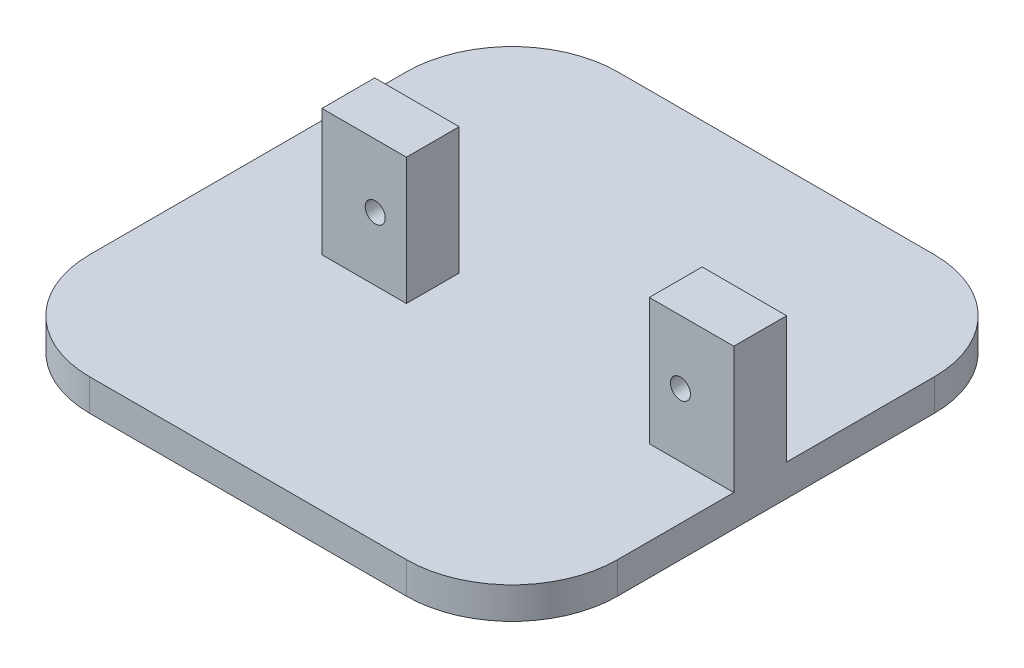
ISO-10303-21;
HEADER;
FILE_DESCRIPTION(('STEP AP214'),'2;1');
FILE_NAME('part.step','',(''),(''),'','','');
FILE_SCHEMA(('AUTOMOTIVE_DESIGN { 1 0 10303 214 1 1 1 1 }'));
ENDSEC;
DATA;
#1=APPLICATION_CONTEXT('core data for automotive mechanical design processes');
#2=APPLICATION_PROTOCOL_DEFINITION('international standard','automotive_design',2000,#1);
#3=PRODUCT_CONTEXT('',#1,'mechanical');
#4=PRODUCT('Part','Part','',(#3));
#5=PRODUCT_RELATED_PRODUCT_CATEGORY('part','',(#4));
#6=PRODUCT_DEFINITION_FORMATION('','',#4);
#7=PRODUCT_DEFINITION_CONTEXT('part definition',#1,'design');
#8=PRODUCT_DEFINITION('design','',#6,#7);
#9=PRODUCT_DEFINITION_SHAPE('','',#8);
#10=(LENGTH_UNIT() NAMED_UNIT(*) SI_UNIT(.MILLI.,.METRE.));
#11=(NAMED_UNIT(*) PLANE_ANGLE_UNIT() SI_UNIT($,.RADIAN.));
#12=(NAMED_UNIT(*) SI_UNIT($,.STERADIAN.) SOLID_ANGLE_UNIT());
#13=UNCERTAINTY_MEASURE_WITH_UNIT(LENGTH_MEASURE(1.E-05),#10,'distance_accuracy_value','');
#14=(GEOMETRIC_REPRESENTATION_CONTEXT(3) GLOBAL_UNCERTAINTY_ASSIGNED_CONTEXT((#13)) GLOBAL_UNIT_ASSIGNED_CONTEXT((#10,
#11,#12)) REPRESENTATION_CONTEXT('',''));
#15=CARTESIAN_POINT('',(0.,0.,0.));
#16=DIRECTION('',(0.,0.,1.));
#17=DIRECTION('',(1.,0.,0.));
#18=AXIS2_PLACEMENT_3D('',#15,#16,#17);
#19=CARTESIAN_POINT('',(15.,3.,-15.));
#20=DIRECTION('',(0.,1.,0.));
#21=DIRECTION('',(0.,0.,1.));
#22=AXIS2_PLACEMENT_3D('',#19,#20,#21);
#23=PLANE('',#22);
#24=DIRECTION('',(0.,0.,1.));
#25=VECTOR('',#24,1.);
#26=CARTESIAN_POINT('',(25.,3.,-14.9999999999999));
#27=LINE('',#26,#25);
#28=CARTESIAN_POINT('',(25.,3.,4.));
#29=VERTEX_POINT('',#28);
#30=CARTESIAN_POINT('',(25.,3.,14.9999999999999));
#31=VERTEX_POINT('',#30);
#32=EDGE_CURVE('E222',#29,#31,#27,.T.);
#33=ORIENTED_EDGE('',*,*,#32,.F.);
#34=DIRECTION('',(-1.,0.,0.));
#35=VECTOR('',#34,1.);
#36=CARTESIAN_POINT('',(15.,3.,4.));
#37=LINE('',#36,#35);
#38=CARTESIAN_POINT('',(17.,3.,4.));
#39=VERTEX_POINT('',#38);
#40=EDGE_CURVE('E209',#29,#39,#37,.T.);
#41=ORIENTED_EDGE('',*,*,#40,.T.);
#42=DIRECTION('',(0.,0.,-1.));
#43=VECTOR('',#42,1.);
#44=CARTESIAN_POINT('',(17.,3.,-15.));
#45=LINE('',#44,#43);
#46=CARTESIAN_POINT('',(17.,3.,-1.));
#47=VERTEX_POINT('',#46);
#48=EDGE_CURVE('E212',#39,#47,#45,.T.);
#49=ORIENTED_EDGE('',*,*,#48,.T.);
#50=DIRECTION('',(1.,0.,0.));
#51=VECTOR('',#50,1.);
#52=CARTESIAN_POINT('',(15.,3.,-1.));
#53=LINE('',#52,#51);
#54=CARTESIAN_POINT('',(25.,3.,-1.));
#55=VERTEX_POINT('',#54);
#56=EDGE_CURVE('E207',#47,#55,#53,.T.);
#57=ORIENTED_EDGE('',*,*,#56,.T.);
#58=CARTESIAN_POINT('',(25.,3.,-14.9999999999999));
#59=VERTEX_POINT('',#58);
#60=EDGE_CURVE('E223',#59,#55,#27,.T.);
#61=ORIENTED_EDGE('',*,*,#60,.F.);
#62=CARTESIAN_POINT('',(15.,3.,-15.));
#63=DIRECTION('',(0.,1.,0.));
#64=DIRECTION('',(0.,0.,1.));
#65=AXIS2_PLACEMENT_3D('',#62,#63,#64);
#66=CIRCLE('',#65,10.);
#67=CARTESIAN_POINT('',(14.9999999999999,3.,-25.));
#68=VERTEX_POINT('',#67);
#69=EDGE_CURVE('E219',#59,#68,#66,.T.);
#70=ORIENTED_EDGE('',*,*,#69,.T.);
#71=DIRECTION('',(1.,0.,0.));
#72=VECTOR('',#71,1.);
#73=CARTESIAN_POINT('',(-14.9999999999999,3.,-25.));
#74=LINE('',#73,#72);
#75=CARTESIAN_POINT('',(-14.9999999999999,3.,-25.));
#76=VERTEX_POINT('',#75);
#77=EDGE_CURVE('E216',#76,#68,#74,.T.);
#78=ORIENTED_EDGE('',*,*,#77,.F.);
#79=CARTESIAN_POINT('',(-15.,3.,-15.));
#80=DIRECTION('',(0.,1.,0.));
#81=DIRECTION('',(0.,0.,1.));
#82=AXIS2_PLACEMENT_3D('',#79,#80,#81);
#83=CIRCLE('',#82,10.);
#84=CARTESIAN_POINT('',(-25.,3.,-14.9999999999999));
#85=VERTEX_POINT('',#84);
#86=EDGE_CURVE('E236',#76,#85,#83,.T.);
#87=ORIENTED_EDGE('',*,*,#86,.T.);
#88=DIRECTION('',(0.,0.,1.));
#89=VECTOR('',#88,1.);
#90=CARTESIAN_POINT('',(-25.,3.,-14.9999999999999));
#91=LINE('',#90,#89);
#92=CARTESIAN_POINT('',(-25.,3.,14.9999999999999));
#93=VERTEX_POINT('',#92);
#94=EDGE_CURVE('E234',#85,#93,#91,.T.);
#95=ORIENTED_EDGE('',*,*,#94,.T.);
#96=CARTESIAN_POINT('',(-15.,3.,15.));
#97=DIRECTION('',(0.,-1.,0.));
#98=DIRECTION('',(0.,0.,-1.));
#99=AXIS2_PLACEMENT_3D('',#96,#97,#98);
#100=CIRCLE('',#99,10.);
#101=CARTESIAN_POINT('',(-14.9999999999999,3.,25.));
#102=VERTEX_POINT('',#101);
#103=EDGE_CURVE('E231',#102,#93,#100,.T.);
#104=ORIENTED_EDGE('',*,*,#103,.F.);
#105=DIRECTION('',(1.,0.,0.));
#106=VECTOR('',#105,1.);
#107=CARTESIAN_POINT('',(-14.9999999999999,3.,25.));
#108=LINE('',#107,#106);
#109=CARTESIAN_POINT('',(14.9999999999999,3.,25.));
#110=VERTEX_POINT('',#109);
#111=EDGE_CURVE('E229',#102,#110,#108,.T.);
#112=ORIENTED_EDGE('',*,*,#111,.T.);
#113=CARTESIAN_POINT('',(15.,3.,15.));
#114=DIRECTION('',(0.,-1.,0.));
#115=DIRECTION('',(0.,0.,-1.));
#116=AXIS2_PLACEMENT_3D('',#113,#114,#115);
#117=CIRCLE('',#116,10.);
#118=EDGE_CURVE('E226',#31,#110,#117,.T.);
#119=ORIENTED_EDGE('',*,*,#118,.F.);
#120=EDGE_LOOP('',(#33,#41,#49,#57,#61,#70,#78,#87,#95,#104,#112,#119));
#121=FACE_BOUND('',#120,.T.);
#122=DIRECTION('',(-1.,0.,0.));
#123=VECTOR('',#122,1.);
#124=CARTESIAN_POINT('',(15.,3.,3.99999999999999));
#125=LINE('',#124,#123);
#126=CARTESIAN_POINT('',(-5.99999999999999,3.,4.));
#127=VERTEX_POINT('',#126);
#128=CARTESIAN_POINT('',(-14.,3.,4.));
#129=VERTEX_POINT('',#128);
#130=EDGE_CURVE('E185',#127,#129,#125,.T.);
#131=ORIENTED_EDGE('',*,*,#130,.T.);
#132=DIRECTION('',(0.,0.,-1.));
#133=VECTOR('',#132,1.);
#134=CARTESIAN_POINT('',(-14.,3.,-15.));
#135=LINE('',#134,#133);
#136=CARTESIAN_POINT('',(-14.,3.,-1.));
#137=VERTEX_POINT('',#136);
#138=EDGE_CURVE('E174',#129,#137,#135,.T.);
#139=ORIENTED_EDGE('',*,*,#138,.T.);
#140=DIRECTION('',(1.,0.,0.));
#141=VECTOR('',#140,1.);
#142=CARTESIAN_POINT('',(15.,3.,-1.));
#143=LINE('',#142,#141);
#144=CARTESIAN_POINT('',(-6.,3.,-1.));
#145=VERTEX_POINT('',#144);
#146=EDGE_CURVE('E175',#137,#145,#143,.T.);
#147=ORIENTED_EDGE('',*,*,#146,.T.);
#148=DIRECTION('',(0.,0.,1.));
#149=VECTOR('',#148,1.);
#150=CARTESIAN_POINT('',(-5.99999999999999,3.,-15.));
#151=LINE('',#150,#149);
#152=EDGE_CURVE('E178',#145,#127,#151,.T.);
#153=ORIENTED_EDGE('',*,*,#152,.T.);
#154=EDGE_LOOP('',(#131,#139,#147,#153));
#155=FACE_BOUND('',#154,.T.);
#156=ADVANCED_FACE('F35',(#121,#155),#23,.T.);
#157=CARTESIAN_POINT('',(-14.9999999999999,3.,-25.));
#158=DIRECTION('',(0.,0.,-1.));
#159=DIRECTION('',(-1.,0.,0.));
#160=AXIS2_PLACEMENT_3D('',#157,#158,#159);
#161=PLANE('',#160);
#162=DIRECTION('',(1.,0.,0.));
#163=VECTOR('',#162,1.);
#164=CARTESIAN_POINT('',(-14.9999999999999,0.,-25.));
#165=LINE('',#164,#163);
#166=CARTESIAN_POINT('',(-14.9999999999999,0.,-25.));
#167=VERTEX_POINT('',#166);
#168=CARTESIAN_POINT('',(14.9999999999999,0.,-25.));
#169=VERTEX_POINT('',#168);
#170=EDGE_CURVE('E215',#167,#169,#165,.T.);
#171=ORIENTED_EDGE('',*,*,#170,.F.);
#172=DIRECTION('',(0.,-1.,0.));
#173=VECTOR('',#172,1.);
#174=CARTESIAN_POINT('',(-14.9999999999999,3.,-25.));
#175=LINE('',#174,#173);
#176=EDGE_CURVE('E11',#76,#167,#175,.T.);
#177=ORIENTED_EDGE('',*,*,#176,.F.);
#178=ORIENTED_EDGE('',*,*,#77,.T.);
#179=DIRECTION('',(0.,-1.,0.));
#180=VECTOR('',#179,1.);
#181=CARTESIAN_POINT('',(14.9999999999999,3.,-25.));
#182=LINE('',#181,#180);
#183=EDGE_CURVE('E39',#68,#169,#182,.T.);
#184=ORIENTED_EDGE('',*,*,#183,.T.);
#185=EDGE_LOOP('',(#171,#177,#178,#184));
#186=FACE_BOUND('',#185,.T.);
#187=ADVANCED_FACE('F37',(#186),#161,.T.);
#188=CARTESIAN_POINT('',(-15.,3.,-15.));
#189=DIRECTION('',(0.,-1.,0.));
#190=DIRECTION('',(0.,0.,-1.));
#191=AXIS2_PLACEMENT_3D('',#188,#189,#190);
#192=CYLINDRICAL_SURFACE('',#191,10.);
#193=CARTESIAN_POINT('',(-15.,0.,-15.));
#194=DIRECTION('',(0.,1.,0.));
#195=DIRECTION('',(0.,0.,1.));
#196=AXIS2_PLACEMENT_3D('',#193,#194,#195);
#197=CIRCLE('',#196,10.);
#198=CARTESIAN_POINT('',(-25.,0.,-14.9999999999999));
#199=VERTEX_POINT('',#198);
#200=EDGE_CURVE('E220',#167,#199,#197,.T.);
#201=ORIENTED_EDGE('',*,*,#200,.T.);
#202=DIRECTION('',(0.,-1.,0.));
#203=VECTOR('',#202,1.);
#204=CARTESIAN_POINT('',(-25.,3.,-14.9999999999999));
#205=LINE('',#204,#203);
#206=EDGE_CURVE('E44',#85,#199,#205,.T.);
#207=ORIENTED_EDGE('',*,*,#206,.F.);
#208=ORIENTED_EDGE('',*,*,#86,.F.);
#209=ORIENTED_EDGE('',*,*,#176,.T.);
#210=EDGE_LOOP('',(#201,#207,#208,#209));
#211=FACE_BOUND('',#210,.T.);
#212=ADVANCED_FACE('F284',(#211),#192,.T.);
#213=CARTESIAN_POINT('',(-25.,3.,-14.9999999999999));
#214=DIRECTION('',(1.,0.,0.));
#215=DIRECTION('',(0.,0.,-1.));
#216=AXIS2_PLACEMENT_3D('',#213,#214,#215);
#217=PLANE('',#216);
#218=DIRECTION('',(0.,0.,1.));
#219=VECTOR('',#218,1.);
#220=CARTESIAN_POINT('',(-25.,0.,-14.9999999999999));
#221=LINE('',#220,#219);
#222=CARTESIAN_POINT('',(-25.,0.,14.9999999999999));
#223=VERTEX_POINT('',#222);
#224=EDGE_CURVE('E254',#199,#223,#221,.T.);
#225=ORIENTED_EDGE('',*,*,#224,.T.);
#226=DIRECTION('',(0.,-1.,0.));
#227=VECTOR('',#226,1.);
#228=CARTESIAN_POINT('',(-25.,3.,14.9999999999999));
#229=LINE('',#228,#227);
#230=EDGE_CURVE('E260',#93,#223,#229,.T.);
#231=ORIENTED_EDGE('',*,*,#230,.F.);
#232=ORIENTED_EDGE('',*,*,#94,.F.);
#233=ORIENTED_EDGE('',*,*,#206,.T.);
#234=EDGE_LOOP('',(#225,#231,#232,#233));
#235=FACE_BOUND('',#234,.T.);
#236=ADVANCED_FACE('F288',(#235),#217,.F.);
#237=CARTESIAN_POINT('',(-15.,3.,15.));
#238=DIRECTION('',(0.,-1.,0.));
#239=DIRECTION('',(0.,0.,-1.));
#240=AXIS2_PLACEMENT_3D('',#237,#238,#239);
#241=CYLINDRICAL_SURFACE('',#240,10.);
#242=CARTESIAN_POINT('',(-15.,0.,15.));
#243=DIRECTION('',(0.,-1.,0.));
#244=DIRECTION('',(0.,0.,-1.));
#245=AXIS2_PLACEMENT_3D('',#242,#243,#244);
#246=CIRCLE('',#245,10.);
#247=CARTESIAN_POINT('',(-14.9999999999999,0.,25.));
#248=VERTEX_POINT('',#247);
#249=EDGE_CURVE('E251',#248,#223,#246,.T.);
#250=ORIENTED_EDGE('',*,*,#249,.F.);
#251=DIRECTION('',(0.,-1.,0.));
#252=VECTOR('',#251,1.);
#253=CARTESIAN_POINT('',(-14.9999999999999,3.,25.));
#254=LINE('',#253,#252);
#255=EDGE_CURVE('E262',#102,#248,#254,.T.);
#256=ORIENTED_EDGE('',*,*,#255,.F.);
#257=ORIENTED_EDGE('',*,*,#103,.T.);
#258=ORIENTED_EDGE('',*,*,#230,.T.);
#259=EDGE_LOOP('',(#250,#256,#257,#258));
#260=FACE_BOUND('',#259,.T.);
#261=ADVANCED_FACE('F310',(#260),#241,.T.);
#262=CARTESIAN_POINT('',(-14.9999999999999,3.,25.));
#263=DIRECTION('',(0.,0.,-1.));
#264=DIRECTION('',(-1.,0.,0.));
#265=AXIS2_PLACEMENT_3D('',#262,#263,#264);
#266=PLANE('',#265);
#267=DIRECTION('',(1.,0.,0.));
#268=VECTOR('',#267,1.);
#269=CARTESIAN_POINT('',(-14.9999999999999,0.,25.));
#270=LINE('',#269,#268);
#271=CARTESIAN_POINT('',(14.9999999999999,0.,25.));
#272=VERTEX_POINT('',#271);
#273=EDGE_CURVE('E248',#248,#272,#270,.T.);
#274=ORIENTED_EDGE('',*,*,#273,.T.);
#275=DIRECTION('',(0.,-1.,0.));
#276=VECTOR('',#275,1.);
#277=CARTESIAN_POINT('',(14.9999999999999,3.,25.));
#278=LINE('',#277,#276);
#279=EDGE_CURVE('E264',#110,#272,#278,.T.);
#280=ORIENTED_EDGE('',*,*,#279,.F.);
#281=ORIENTED_EDGE('',*,*,#111,.F.);
#282=ORIENTED_EDGE('',*,*,#255,.T.);
#283=EDGE_LOOP('',(#274,#280,#281,#282));
#284=FACE_BOUND('',#283,.T.);
#285=ADVANCED_FACE('F308',(#284),#266,.F.);
#286=CARTESIAN_POINT('',(15.,3.,15.));
#287=DIRECTION('',(0.,-1.,0.));
#288=DIRECTION('',(0.,0.,-1.));
#289=AXIS2_PLACEMENT_3D('',#286,#287,#288);
#290=CYLINDRICAL_SURFACE('',#289,10.);
#291=CARTESIAN_POINT('',(15.,0.,15.));
#292=DIRECTION('',(0.,-1.,0.));
#293=DIRECTION('',(0.,0.,-1.));
#294=AXIS2_PLACEMENT_3D('',#291,#292,#293);
#295=CIRCLE('',#294,10.);
#296=CARTESIAN_POINT('',(25.,0.,14.9999999999999));
#297=VERTEX_POINT('',#296);
#298=EDGE_CURVE('E245',#297,#272,#295,.T.);
#299=ORIENTED_EDGE('',*,*,#298,.F.);
#300=DIRECTION('',(0.,-1.,0.));
#301=VECTOR('',#300,1.);
#302=CARTESIAN_POINT('',(25.,3.,14.9999999999999));
#303=LINE('',#302,#301);
#304=EDGE_CURVE('E266',#31,#297,#303,.T.);
#305=ORIENTED_EDGE('',*,*,#304,.F.);
#306=ORIENTED_EDGE('',*,*,#118,.T.);
#307=ORIENTED_EDGE('',*,*,#279,.T.);
#308=EDGE_LOOP('',(#299,#305,#306,#307));
#309=FACE_BOUND('',#308,.T.);
#310=ADVANCED_FACE('F303',(#309),#290,.T.);
#311=CARTESIAN_POINT('',(25.,3.,-14.9999999999999));
#312=DIRECTION('',(1.,0.,0.));
#313=DIRECTION('',(0.,0.,-1.));
#314=AXIS2_PLACEMENT_3D('',#311,#312,#313);
#315=PLANE('',#314);
#316=DIRECTION('',(0.,-1.,0.));
#317=VECTOR('',#316,1.);
#318=CARTESIAN_POINT('',(25.,15.,4.));
#319=LINE('',#318,#317);
#320=CARTESIAN_POINT('',(25.,15.,4.));
#321=VERTEX_POINT('',#320);
#322=EDGE_CURVE('E201',#321,#29,#319,.T.);
#323=ORIENTED_EDGE('',*,*,#322,.T.);
#324=ORIENTED_EDGE('',*,*,#32,.T.);
#325=ORIENTED_EDGE('',*,*,#304,.T.);
#326=DIRECTION('',(0.,0.,1.));
#327=VECTOR('',#326,1.);
#328=CARTESIAN_POINT('',(25.,0.,-14.9999999999999));
#329=LINE('',#328,#327);
#330=CARTESIAN_POINT('',(25.,0.,-14.9999999999999));
#331=VERTEX_POINT('',#330);
#332=EDGE_CURVE('E243',#331,#297,#329,.T.);
#333=ORIENTED_EDGE('',*,*,#332,.F.);
#334=DIRECTION('',(0.,-1.,0.));
#335=VECTOR('',#334,1.);
#336=CARTESIAN_POINT('',(25.,3.,-14.9999999999999));
#337=LINE('',#336,#335);
#338=EDGE_CURVE('E268',#59,#331,#337,.T.);
#339=ORIENTED_EDGE('',*,*,#338,.F.);
#340=ORIENTED_EDGE('',*,*,#60,.T.);
#341=DIRECTION('',(0.,-1.,0.));
#342=VECTOR('',#341,1.);
#343=CARTESIAN_POINT('',(25.,15.,-1.));
#344=LINE('',#343,#342);
#345=CARTESIAN_POINT('',(25.,15.,-1.));
#346=VERTEX_POINT('',#345);
#347=EDGE_CURVE('E60',#346,#55,#344,.T.);
#348=ORIENTED_EDGE('',*,*,#347,.F.);
#349=DIRECTION('',(0.,0.,-1.));
#350=VECTOR('',#349,1.);
#351=CARTESIAN_POINT('',(25.,15.,-1.));
#352=LINE('',#351,#350);
#353=EDGE_CURVE('E193',#321,#346,#352,.T.);
#354=ORIENTED_EDGE('',*,*,#353,.F.);
#355=EDGE_LOOP('',(#323,#324,#325,#333,#339,#340,#348,#354));
#356=FACE_BOUND('',#355,.T.);
#357=ADVANCED_FACE('F296',(#356),#315,.T.);
#358=CARTESIAN_POINT('',(15.,3.,-15.));
#359=DIRECTION('',(0.,-1.,0.));
#360=DIRECTION('',(0.,0.,-1.));
#361=AXIS2_PLACEMENT_3D('',#358,#359,#360);
#362=CYLINDRICAL_SURFACE('',#361,10.);
#363=CARTESIAN_POINT('',(15.,0.,-15.));
#364=DIRECTION('',(0.,1.,0.));
#365=DIRECTION('',(0.,0.,1.));
#366=AXIS2_PLACEMENT_3D('',#363,#364,#365);
#367=CIRCLE('',#366,10.);
#368=EDGE_CURVE('E240',#331,#169,#367,.T.);
#369=ORIENTED_EDGE('',*,*,#368,.T.);
#370=ORIENTED_EDGE('',*,*,#183,.F.);
#371=ORIENTED_EDGE('',*,*,#69,.F.);
#372=ORIENTED_EDGE('',*,*,#338,.T.);
#373=EDGE_LOOP('',(#369,#370,#371,#372));
#374=FACE_BOUND('',#373,.T.);
#375=ADVANCED_FACE('F276',(#374),#362,.T.);
#376=CARTESIAN_POINT('',(15.,0.,-15.));
#377=DIRECTION('',(0.,1.,0.));
#378=DIRECTION('',(0.,0.,1.));
#379=AXIS2_PLACEMENT_3D('',#376,#377,#378);
#380=PLANE('',#379);
#381=ORIENTED_EDGE('',*,*,#332,.T.);
#382=ORIENTED_EDGE('',*,*,#298,.T.);
#383=ORIENTED_EDGE('',*,*,#273,.F.);
#384=ORIENTED_EDGE('',*,*,#249,.T.);
#385=ORIENTED_EDGE('',*,*,#224,.F.);
#386=ORIENTED_EDGE('',*,*,#200,.F.);
#387=ORIENTED_EDGE('',*,*,#170,.T.);
#388=ORIENTED_EDGE('',*,*,#368,.F.);
#389=EDGE_LOOP('',(#381,#382,#383,#384,#385,#386,#387,#388));
#390=FACE_BOUND('',#389,.T.);
#391=ADVANCED_FACE('F280',(#390),#380,.F.);
#392=CARTESIAN_POINT('',(17.,15.,-1.));
#393=DIRECTION('',(1.,0.,0.));
#394=DIRECTION('',(0.,0.,-1.));
#395=AXIS2_PLACEMENT_3D('',#392,#393,#394);
#396=PLANE('',#395);
#397=ORIENTED_EDGE('',*,*,#48,.F.);
#398=DIRECTION('',(0.,-1.,0.));
#399=VECTOR('',#398,1.);
#400=CARTESIAN_POINT('',(17.,15.,4.));
#401=LINE('',#400,#399);
#402=CARTESIAN_POINT('',(17.,15.,4.));
#403=VERTEX_POINT('',#402);
#404=EDGE_CURVE('E204',#403,#39,#401,.T.);
#405=ORIENTED_EDGE('',*,*,#404,.F.);
#406=DIRECTION('',(0.,0.,1.));
#407=VECTOR('',#406,1.);
#408=CARTESIAN_POINT('',(17.,15.,-1.));
#409=LINE('',#408,#407);
#410=CARTESIAN_POINT('',(17.,15.,-1.));
#411=VERTEX_POINT('',#410);
#412=EDGE_CURVE('E188',#411,#403,#409,.T.);
#413=ORIENTED_EDGE('',*,*,#412,.F.);
#414=DIRECTION('',(0.,-1.,0.));
#415=VECTOR('',#414,1.);
#416=CARTESIAN_POINT('',(17.,15.,-1.));
#417=LINE('',#416,#415);
#418=EDGE_CURVE('E197',#411,#47,#417,.T.);
#419=ORIENTED_EDGE('',*,*,#418,.T.);
#420=EDGE_LOOP('',(#397,#405,#413,#419));
#421=FACE_BOUND('',#420,.T.);
#422=ADVANCED_FACE('F326',(#421),#396,.F.);
#423=CARTESIAN_POINT('',(17.,15.,4.));
#424=DIRECTION('',(0.,0.,-1.));
#425=DIRECTION('',(-1.,0.,0.));
#426=AXIS2_PLACEMENT_3D('',#423,#424,#425);
#427=PLANE('',#426);
#428=CARTESIAN_POINT('',(19.95,9.,4.));
#429=DIRECTION('',(0.,0.,-1.));
#430=DIRECTION('',(-1.,0.,0.));
#431=AXIS2_PLACEMENT_3D('',#428,#429,#430);
#432=CIRCLE('',#431,0.950000000000001);
#433=CARTESIAN_POINT('',(19.,9.,4.));
#434=VERTEX_POINT('',#433);
#435=EDGE_CURVE('E495',#434,#434,#432,.T.);
#436=ORIENTED_EDGE('',*,*,#435,.T.);
#437=EDGE_LOOP('',(#436));
#438=FACE_BOUND('',#437,.T.);
#439=ORIENTED_EDGE('',*,*,#40,.F.);
#440=ORIENTED_EDGE('',*,*,#322,.F.);
#441=DIRECTION('',(1.,0.,0.));
#442=VECTOR('',#441,1.);
#443=CARTESIAN_POINT('',(17.,15.,4.));
#444=LINE('',#443,#442);
#445=EDGE_CURVE('E191',#403,#321,#444,.T.);
#446=ORIENTED_EDGE('',*,*,#445,.F.);
#447=ORIENTED_EDGE('',*,*,#404,.T.);
#448=EDGE_LOOP('',(#439,#440,#446,#447));
#449=FACE_BOUND('',#448,.T.);
#450=ADVANCED_FACE('F392',(#438,#449),#427,.F.);
#451=CARTESIAN_POINT('',(17.,15.,-1.));
#452=DIRECTION('',(0.,0.,1.));
#453=DIRECTION('',(1.,0.,0.));
#454=AXIS2_PLACEMENT_3D('',#451,#452,#453);
#455=PLANE('',#454);
#456=CARTESIAN_POINT('',(19.95,9.,-1.00000000000001));
#457=DIRECTION('',(0.,0.,-1.));
#458=DIRECTION('',(-1.,0.,0.));
#459=AXIS2_PLACEMENT_3D('',#456,#457,#458);
#460=CIRCLE('',#459,0.950000000000001);
#461=CARTESIAN_POINT('',(19.,9.,-1.));
#462=VERTEX_POINT('',#461);
#463=EDGE_CURVE('E492',#462,#462,#460,.T.);
#464=ORIENTED_EDGE('',*,*,#463,.F.);
#465=EDGE_LOOP('',(#464));
#466=FACE_BOUND('',#465,.T.);
#467=ORIENTED_EDGE('',*,*,#56,.F.);
#468=ORIENTED_EDGE('',*,*,#418,.F.);
#469=DIRECTION('',(-1.,0.,0.));
#470=VECTOR('',#469,1.);
#471=CARTESIAN_POINT('',(17.,15.,-1.));
#472=LINE('',#471,#470);
#473=EDGE_CURVE('E195',#346,#411,#472,.T.);
#474=ORIENTED_EDGE('',*,*,#473,.F.);
#475=ORIENTED_EDGE('',*,*,#347,.T.);
#476=EDGE_LOOP('',(#467,#468,#474,#475));
#477=FACE_BOUND('',#476,.T.);
#478=ADVANCED_FACE('F404',(#466,#477),#455,.F.);
#479=CARTESIAN_POINT('',(0.,15.,0.));
#480=DIRECTION('',(0.,1.,0.));
#481=DIRECTION('',(0.,0.,1.));
#482=AXIS2_PLACEMENT_3D('',#479,#480,#481);
#483=PLANE('',#482);
#484=ORIENTED_EDGE('',*,*,#412,.T.);
#485=ORIENTED_EDGE('',*,*,#445,.T.);
#486=ORIENTED_EDGE('',*,*,#353,.T.);
#487=ORIENTED_EDGE('',*,*,#473,.T.);
#488=EDGE_LOOP('',(#484,#485,#486,#487));
#489=FACE_BOUND('',#488,.T.);
#490=ADVANCED_FACE('F399',(#489),#483,.T.);
#491=CARTESIAN_POINT('',(-14.,15.,-1.));
#492=DIRECTION('',(1.,0.,0.));
#493=DIRECTION('',(0.,0.,-1.));
#494=AXIS2_PLACEMENT_3D('',#491,#492,#493);
#495=PLANE('',#494);
#496=ORIENTED_EDGE('',*,*,#138,.F.);
#497=DIRECTION('',(0.,-1.,0.));
#498=VECTOR('',#497,1.);
#499=CARTESIAN_POINT('',(-14.,15.,4.));
#500=LINE('',#499,#498);
#501=CARTESIAN_POINT('',(-14.,15.,4.));
#502=VERTEX_POINT('',#501);
#503=EDGE_CURVE('E155',#502,#129,#500,.T.);
#504=ORIENTED_EDGE('',*,*,#503,.F.);
#505=DIRECTION('',(0.,0.,1.));
#506=VECTOR('',#505,1.);
#507=CARTESIAN_POINT('',(-14.,15.,-1.));
#508=LINE('',#507,#506);
#509=CARTESIAN_POINT('',(-14.,15.,-1.));
#510=VERTEX_POINT('',#509);
#511=EDGE_CURVE('E162',#510,#502,#508,.T.);
#512=ORIENTED_EDGE('',*,*,#511,.F.);
#513=DIRECTION('',(0.,-1.,0.));
#514=VECTOR('',#513,1.);
#515=CARTESIAN_POINT('',(-14.,15.,-1.));
#516=LINE('',#515,#514);
#517=EDGE_CURVE('E506',#510,#137,#516,.T.);
#518=ORIENTED_EDGE('',*,*,#517,.T.);
#519=EDGE_LOOP('',(#496,#504,#512,#518));
#520=FACE_BOUND('',#519,.T.);
#521=ADVANCED_FACE('F172',(#520),#495,.F.);
#522=CARTESIAN_POINT('',(-5.99999999999999,15.,4.));
#523=DIRECTION('',(0.,0.,-1.));
#524=DIRECTION('',(-1.,0.,0.));
#525=AXIS2_PLACEMENT_3D('',#522,#523,#524);
#526=PLANE('',#525);
#527=CARTESIAN_POINT('',(-8.95,9.,4.));
#528=DIRECTION('',(0.,0.,-1.));
#529=DIRECTION('',(-1.,0.,0.));
#530=AXIS2_PLACEMENT_3D('',#527,#528,#529);
#531=CIRCLE('',#530,0.949999999999999);
#532=CARTESIAN_POINT('',(-9.9,9.,4.));
#533=VERTEX_POINT('',#532);
#534=EDGE_CURVE('E170',#533,#533,#531,.T.);
#535=ORIENTED_EDGE('',*,*,#534,.T.);
#536=EDGE_LOOP('',(#535));
#537=FACE_BOUND('',#536,.T.);
#538=ORIENTED_EDGE('',*,*,#130,.F.);
#539=DIRECTION('',(0.,-1.,0.));
#540=VECTOR('',#539,1.);
#541=CARTESIAN_POINT('',(-5.99999999999999,15.,4.));
#542=LINE('',#541,#540);
#543=CARTESIAN_POINT('',(-5.99999999999999,15.,4.));
#544=VERTEX_POINT('',#543);
#545=EDGE_CURVE('E158',#544,#127,#542,.T.);
#546=ORIENTED_EDGE('',*,*,#545,.F.);
#547=DIRECTION('',(1.,0.,0.));
#548=VECTOR('',#547,1.);
#549=CARTESIAN_POINT('',(-5.99999999999999,15.,4.));
#550=LINE('',#549,#548);
#551=EDGE_CURVE('E151',#502,#544,#550,.T.);
#552=ORIENTED_EDGE('',*,*,#551,.F.);
#553=ORIENTED_EDGE('',*,*,#503,.T.);
#554=EDGE_LOOP('',(#538,#546,#552,#553));
#555=FACE_BOUND('',#554,.T.);
#556=ADVANCED_FACE('F153',(#537,#555),#526,.F.);
#557=CARTESIAN_POINT('',(-5.99999999999999,15.,-1.));
#558=DIRECTION('',(-1.,0.,0.));
#559=DIRECTION('',(0.,0.,1.));
#560=AXIS2_PLACEMENT_3D('',#557,#558,#559);
#561=PLANE('',#560);
#562=ORIENTED_EDGE('',*,*,#152,.F.);
#563=DIRECTION('',(0.,-1.,0.));
#564=VECTOR('',#563,1.);
#565=CARTESIAN_POINT('',(-5.99999999999999,15.,-1.));
#566=LINE('',#565,#564);
#567=CARTESIAN_POINT('',(-5.99999999999999,15.,-1.));
#568=VERTEX_POINT('',#567);
#569=EDGE_CURVE('E52',#568,#145,#566,.T.);
#570=ORIENTED_EDGE('',*,*,#569,.F.);
#571=DIRECTION('',(0.,0.,-1.));
#572=VECTOR('',#571,1.);
#573=CARTESIAN_POINT('',(-5.99999999999999,15.,-1.));
#574=LINE('',#573,#572);
#575=EDGE_CURVE('E161',#544,#568,#574,.T.);
#576=ORIENTED_EDGE('',*,*,#575,.F.);
#577=ORIENTED_EDGE('',*,*,#545,.T.);
#578=EDGE_LOOP('',(#562,#570,#576,#577));
#579=FACE_BOUND('',#578,.T.);
#580=ADVANCED_FACE('F422',(#579),#561,.F.);
#581=CARTESIAN_POINT('',(-5.99999999999999,15.,-1.));
#582=DIRECTION('',(0.,0.,1.));
#583=DIRECTION('',(1.,0.,0.));
#584=AXIS2_PLACEMENT_3D('',#581,#582,#583);
#585=PLANE('',#584);
#586=CARTESIAN_POINT('',(-8.95,9.,-1.));
#587=DIRECTION('',(0.,0.,-1.));
#588=DIRECTION('',(-1.,0.,0.));
#589=AXIS2_PLACEMENT_3D('',#586,#587,#588);
#590=CIRCLE('',#589,0.949999999999999);
#591=CARTESIAN_POINT('',(-9.9,9.,-1.));
#592=VERTEX_POINT('',#591);
#593=EDGE_CURVE('E496',#592,#592,#590,.T.);
#594=ORIENTED_EDGE('',*,*,#593,.F.);
#595=EDGE_LOOP('',(#594));
#596=FACE_BOUND('',#595,.T.);
#597=ORIENTED_EDGE('',*,*,#146,.F.);
#598=ORIENTED_EDGE('',*,*,#517,.F.);
#599=DIRECTION('',(-1.,0.,0.));
#600=VECTOR('',#599,1.);
#601=CARTESIAN_POINT('',(-5.99999999999999,15.,-1.));
#602=LINE('',#601,#600);
#603=EDGE_CURVE('E166',#568,#510,#602,.T.);
#604=ORIENTED_EDGE('',*,*,#603,.F.);
#605=ORIENTED_EDGE('',*,*,#569,.T.);
#606=EDGE_LOOP('',(#597,#598,#604,#605));
#607=FACE_BOUND('',#606,.T.);
#608=ADVANCED_FACE('F427',(#596,#607),#585,.F.);
#609=CARTESIAN_POINT('',(0.,15.,0.));
#610=DIRECTION('',(0.,-1.,0.));
#611=DIRECTION('',(0.,0.,-1.));
#612=AXIS2_PLACEMENT_3D('',#609,#610,#611);
#613=PLANE('',#612);
#614=ORIENTED_EDGE('',*,*,#511,.T.);
#615=ORIENTED_EDGE('',*,*,#551,.T.);
#616=ORIENTED_EDGE('',*,*,#575,.T.);
#617=ORIENTED_EDGE('',*,*,#603,.T.);
#618=EDGE_LOOP('',(#614,#615,#616,#617));
#619=FACE_BOUND('',#618,.T.);
#620=ADVANCED_FACE('F165',(#619),#613,.F.);
#621=CARTESIAN_POINT('',(-8.94999999999999,9.,14.));
#622=DIRECTION('',(0.,0.,-1.));
#623=DIRECTION('',(-1.,0.,0.));
#624=AXIS2_PLACEMENT_3D('',#621,#622,#623);
#625=CYLINDRICAL_SURFACE('',#624,0.949999999999999);
#626=ORIENTED_EDGE('',*,*,#593,.T.);
#627=EDGE_LOOP('',(#626));
#628=FACE_BOUND('',#627,.T.);
#629=ORIENTED_EDGE('',*,*,#534,.F.);
#630=EDGE_LOOP('',(#629));
#631=FACE_BOUND('',#630,.T.);
#632=ADVANCED_FACE('F439',(#628,#631),#625,.F.);
#633=CARTESIAN_POINT('',(19.95,9.,14.));
#634=DIRECTION('',(0.,0.,-1.));
#635=DIRECTION('',(-1.,0.,0.));
#636=AXIS2_PLACEMENT_3D('',#633,#634,#635);
#637=CYLINDRICAL_SURFACE('',#636,0.950000000000001);
#638=ORIENTED_EDGE('',*,*,#463,.T.);
#639=EDGE_LOOP('',(#638));
#640=FACE_BOUND('',#639,.T.);
#641=ORIENTED_EDGE('',*,*,#435,.F.);
#642=EDGE_LOOP('',(#641));
#643=FACE_BOUND('',#642,.T.);
#644=ADVANCED_FACE('F475',(#640,#643),#637,.F.);
#645=CLOSED_SHELL('',(#156,#187,#212,#236,#261,#285,#310,#357,#375,#391,#422,#450,#478,#490,
#521,#556,#580,#608,#620,#632,#644));
#646=MANIFOLD_SOLID_BREP('B2',#645);
#647=ADVANCED_BREP_SHAPE_REPRESENTATION('',(#18,#646),#14);
#648=SHAPE_DEFINITION_REPRESENTATION(#9,#647);
ENDSEC;
END-ISO-10303-21;
